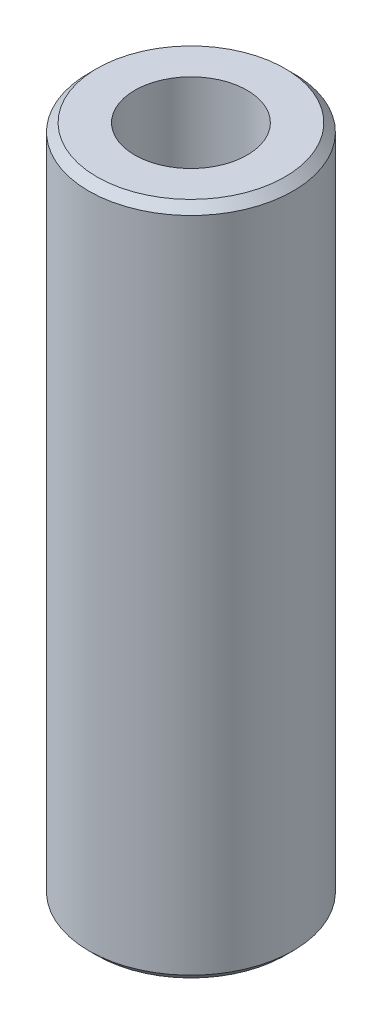
ISO-10303-21;
HEADER;
FILE_DESCRIPTION(('STEP AP214'),'2;1');
FILE_NAME('part.step','',(''),(''),'','','');
FILE_SCHEMA(('AUTOMOTIVE_DESIGN { 1 0 10303 214 1 1 1 1 }'));
ENDSEC;
DATA;
#1=APPLICATION_CONTEXT('core data for automotive mechanical design processes');
#2=APPLICATION_PROTOCOL_DEFINITION('international standard','automotive_design',2000,#1);
#3=PRODUCT_CONTEXT('',#1,'mechanical');
#4=PRODUCT('Part','Part','',(#3));
#5=PRODUCT_RELATED_PRODUCT_CATEGORY('part','',(#4));
#6=PRODUCT_DEFINITION_FORMATION('','',#4);
#7=PRODUCT_DEFINITION_CONTEXT('part definition',#1,'design');
#8=PRODUCT_DEFINITION('design','',#6,#7);
#9=PRODUCT_DEFINITION_SHAPE('','',#8);
#10=(LENGTH_UNIT() NAMED_UNIT(*) SI_UNIT(.MILLI.,.METRE.));
#11=(NAMED_UNIT(*) PLANE_ANGLE_UNIT() SI_UNIT($,.RADIAN.));
#12=(NAMED_UNIT(*) SI_UNIT($,.STERADIAN.) SOLID_ANGLE_UNIT());
#13=UNCERTAINTY_MEASURE_WITH_UNIT(LENGTH_MEASURE(1.E-05),#10,'distance_accuracy_value','');
#14=(GEOMETRIC_REPRESENTATION_CONTEXT(3) GLOBAL_UNCERTAINTY_ASSIGNED_CONTEXT((#13)) GLOBAL_UNIT_ASSIGNED_CONTEXT((#10,
#11,#12)) REPRESENTATION_CONTEXT('',''));
#15=CARTESIAN_POINT('',(0.,0.,0.));
#16=DIRECTION('',(0.,0.,1.));
#17=DIRECTION('',(1.,0.,0.));
#18=AXIS2_PLACEMENT_3D('',#15,#16,#17);
#19=CARTESIAN_POINT('',(0.,16.5,0.));
#20=DIRECTION('',(0.,1.,0.));
#21=DIRECTION('',(0.,0.,1.));
#22=AXIS2_PLACEMENT_3D('',#19,#20,#21);
#23=PLANE('',#22);
#24=CARTESIAN_POINT('',(0.,16.5,0.));
#25=DIRECTION('',(0.,1.,0.));
#26=DIRECTION('',(0.,0.,1.));
#27=AXIS2_PLACEMENT_3D('',#24,#25,#26);
#28=CIRCLE('',#27,4.59999999999999);
#29=CARTESIAN_POINT('',(0.,16.5,4.59999999999999));
#30=VERTEX_POINT('',#29);
#31=EDGE_CURVE('E10',#30,#30,#28,.T.);
#32=ORIENTED_EDGE('',*,*,#31,.T.);
#33=EDGE_LOOP('',(#32));
#34=FACE_BOUND('',#33,.T.);
#35=CARTESIAN_POINT('',(0.,16.5,0.));
#36=DIRECTION('',(0.,1.,0.));
#37=DIRECTION('',(0.,0.,1.));
#38=AXIS2_PLACEMENT_3D('',#35,#36,#37);
#39=CIRCLE('',#38,2.75);
#40=CARTESIAN_POINT('',(0.,16.5,2.75));
#41=VERTEX_POINT('',#40);
#42=EDGE_CURVE('E58',#41,#41,#39,.T.);
#43=ORIENTED_EDGE('',*,*,#42,.F.);
#44=EDGE_LOOP('',(#43));
#45=FACE_BOUND('',#44,.T.);
#46=ADVANCED_FACE('F37',(#34,#45),#23,.T.);
#47=CARTESIAN_POINT('',(0.,-16.5,0.));
#48=DIRECTION('',(0.,1.,0.));
#49=DIRECTION('',(0.,0.,1.));
#50=AXIS2_PLACEMENT_3D('',#47,#48,#49);
#51=PLANE('',#50);
#52=CARTESIAN_POINT('',(0.,-16.5,0.));
#53=DIRECTION('',(0.,1.,0.));
#54=DIRECTION('',(0.,0.,1.));
#55=AXIS2_PLACEMENT_3D('',#52,#53,#54);
#56=CIRCLE('',#55,4.6);
#57=CARTESIAN_POINT('',(0.,-16.5,4.6));
#58=VERTEX_POINT('',#57);
#59=EDGE_CURVE('E45',#58,#58,#56,.F.);
#60=ORIENTED_EDGE('',*,*,#59,.T.);
#61=EDGE_LOOP('',(#60));
#62=FACE_BOUND('',#61,.T.);
#63=CARTESIAN_POINT('',(0.,-16.5,0.));
#64=DIRECTION('',(0.,1.,0.));
#65=DIRECTION('',(0.,0.,1.));
#66=AXIS2_PLACEMENT_3D('',#63,#64,#65);
#67=CIRCLE('',#66,2.75);
#68=CARTESIAN_POINT('',(0.,-16.5,2.75));
#69=VERTEX_POINT('',#68);
#70=EDGE_CURVE('E59',#69,#69,#67,.T.);
#71=ORIENTED_EDGE('',*,*,#70,.T.);
#72=EDGE_LOOP('',(#71));
#73=FACE_BOUND('',#72,.T.);
#74=ADVANCED_FACE('F69',(#62,#73),#51,.F.);
#75=CARTESIAN_POINT('',(0.,16.5,0.));
#76=DIRECTION('',(0.,-1.,0.));
#77=DIRECTION('',(0.,0.,-1.));
#78=AXIS2_PLACEMENT_3D('',#75,#76,#77);
#79=CYLINDRICAL_SURFACE('',#78,5.);
#80=CARTESIAN_POINT('',(0.,-16.1,0.));
#81=DIRECTION('',(0.,1.,0.));
#82=DIRECTION('',(0.,0.,1.));
#83=AXIS2_PLACEMENT_3D('',#80,#81,#82);
#84=CIRCLE('',#83,5.);
#85=CARTESIAN_POINT('',(0.,-16.1,5.));
#86=VERTEX_POINT('',#85);
#87=EDGE_CURVE('E49',#86,#86,#84,.T.);
#88=ORIENTED_EDGE('',*,*,#87,.T.);
#89=EDGE_LOOP('',(#88));
#90=FACE_BOUND('',#89,.T.);
#91=CARTESIAN_POINT('',(0.,16.1,0.));
#92=DIRECTION('',(0.,1.,0.));
#93=DIRECTION('',(0.,0.,1.));
#94=AXIS2_PLACEMENT_3D('',#91,#92,#93);
#95=CIRCLE('',#94,5.);
#96=CARTESIAN_POINT('',(0.,16.1,5.));
#97=VERTEX_POINT('',#96);
#98=EDGE_CURVE('E53',#97,#97,#95,.F.);
#99=ORIENTED_EDGE('',*,*,#98,.T.);
#100=EDGE_LOOP('',(#99));
#101=FACE_BOUND('',#100,.T.);
#102=ADVANCED_FACE('F75',(#90,#101),#79,.T.);
#103=CARTESIAN_POINT('',(0.,16.5,0.));
#104=DIRECTION('',(0.,-1.,0.));
#105=DIRECTION('',(0.,0.,-1.));
#106=AXIS2_PLACEMENT_3D('',#103,#104,#105);
#107=CYLINDRICAL_SURFACE('',#106,2.75);
#108=ORIENTED_EDGE('',*,*,#42,.T.);
#109=EDGE_LOOP('',(#108));
#110=FACE_BOUND('',#109,.T.);
#111=ORIENTED_EDGE('',*,*,#70,.F.);
#112=EDGE_LOOP('',(#111));
#113=FACE_BOUND('',#112,.T.);
#114=ADVANCED_FACE('F65',(#110,#113),#107,.F.);
#115=CARTESIAN_POINT('',(0.,-16.1,0.));
#116=DIRECTION('',(0.,1.,0.));
#117=DIRECTION('',(0.,0.,1.));
#118=AXIS2_PLACEMENT_3D('',#115,#116,#117);
#119=CONICAL_SURFACE('',#118,5.,0.785398163397456);
#120=ORIENTED_EDGE('',*,*,#59,.F.);
#121=EDGE_LOOP('',(#120));
#122=FACE_BOUND('',#121,.T.);
#123=ORIENTED_EDGE('',*,*,#87,.F.);
#124=EDGE_LOOP('',(#123));
#125=FACE_BOUND('',#124,.T.);
#126=ADVANCED_FACE('F82',(#122,#125),#119,.T.);
#127=CARTESIAN_POINT('',(0.,16.5,0.));
#128=DIRECTION('',(0.,-1.,0.));
#129=DIRECTION('',(0.,0.,-1.));
#130=AXIS2_PLACEMENT_3D('',#127,#128,#129);
#131=CONICAL_SURFACE('',#130,4.59999999999999,0.785398163397443);
#132=ORIENTED_EDGE('',*,*,#98,.F.);
#133=EDGE_LOOP('',(#132));
#134=FACE_BOUND('',#133,.T.);
#135=ORIENTED_EDGE('',*,*,#31,.F.);
#136=EDGE_LOOP('',(#135));
#137=FACE_BOUND('',#136,.T.);
#138=ADVANCED_FACE('F40',(#134,#137),#131,.T.);
#139=CLOSED_SHELL('',(#46,#74,#102,#114,#126,#138));
#140=MANIFOLD_SOLID_BREP('B2',#139);
#141=ADVANCED_BREP_SHAPE_REPRESENTATION('',(#18,#140),#14);
#142=SHAPE_DEFINITION_REPRESENTATION(#9,#141);
ENDSEC;
END-ISO-10303-21;
